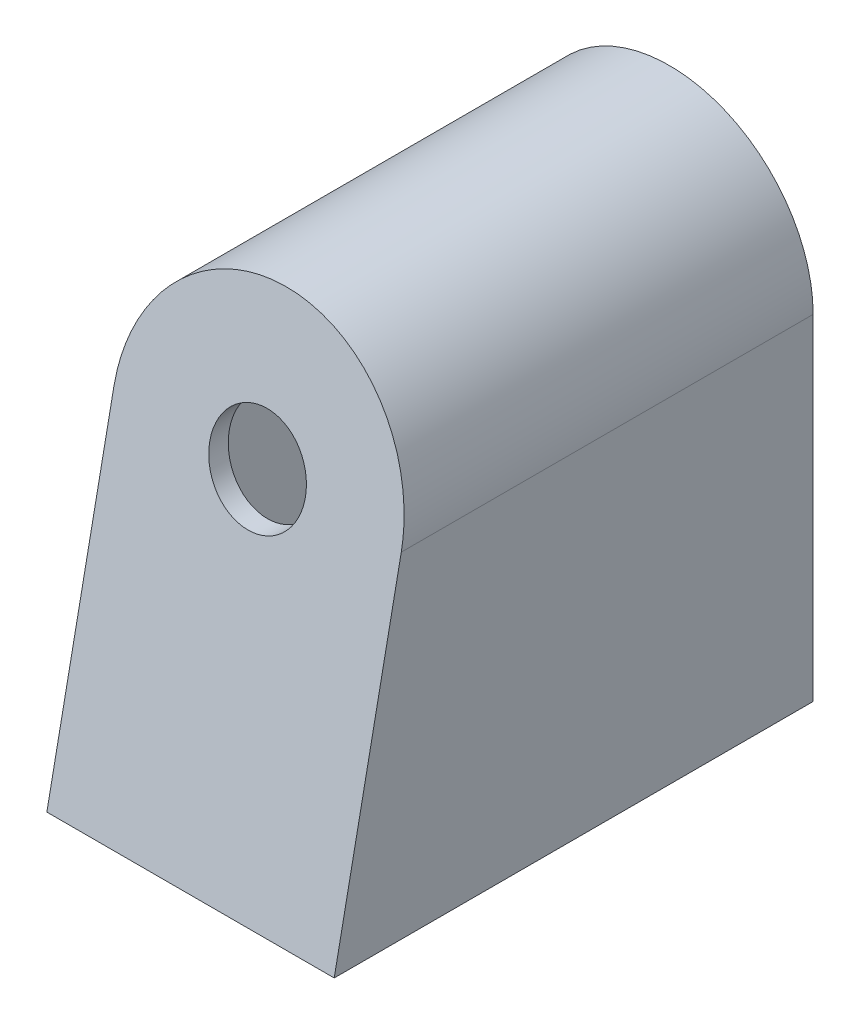
ISO-10303-21;
HEADER;
FILE_DESCRIPTION(('STEP AP214'),'2;1');
FILE_NAME('part.step','',(''),(''),'','','');
FILE_SCHEMA(('AUTOMOTIVE_DESIGN { 1 0 10303 214 1 1 1 1 }'));
ENDSEC;
DATA;
#1=APPLICATION_CONTEXT('core data for automotive mechanical design processes');
#2=APPLICATION_PROTOCOL_DEFINITION('international standard','automotive_design',2000,#1);
#3=PRODUCT_CONTEXT('',#1,'mechanical');
#4=PRODUCT('Part','Part','',(#3));
#5=PRODUCT_RELATED_PRODUCT_CATEGORY('part','',(#4));
#6=PRODUCT_DEFINITION_FORMATION('','',#4);
#7=PRODUCT_DEFINITION_CONTEXT('part definition',#1,'design');
#8=PRODUCT_DEFINITION('design','',#6,#7);
#9=PRODUCT_DEFINITION_SHAPE('','',#8);
#10=(LENGTH_UNIT() NAMED_UNIT(*) SI_UNIT(.MILLI.,.METRE.));
#11=(NAMED_UNIT(*) PLANE_ANGLE_UNIT() SI_UNIT($,.RADIAN.));
#12=(NAMED_UNIT(*) SI_UNIT($,.STERADIAN.) SOLID_ANGLE_UNIT());
#13=UNCERTAINTY_MEASURE_WITH_UNIT(LENGTH_MEASURE(1.E-05),#10,'distance_accuracy_value','');
#14=(GEOMETRIC_REPRESENTATION_CONTEXT(3) GLOBAL_UNCERTAINTY_ASSIGNED_CONTEXT((#13)) GLOBAL_UNIT_ASSIGNED_CONTEXT((#10,
#11,#12)) REPRESENTATION_CONTEXT('',''));
#15=CARTESIAN_POINT('',(0.,0.,0.));
#16=DIRECTION('',(0.,0.,1.));
#17=DIRECTION('',(1.,0.,0.));
#18=AXIS2_PLACEMENT_3D('',#15,#16,#17);
#19=CARTESIAN_POINT('',(0.,17.5,-50.));
#20=DIRECTION('',(0.,0.,1.));
#21=DIRECTION('',(1.,0.,0.));
#22=AXIS2_PLACEMENT_3D('',#19,#20,#21);
#23=CYLINDRICAL_SURFACE('',#22,5.);
#24=CARTESIAN_POINT('',(0.,17.5,-7.));
#25=DIRECTION('',(0.,-0.196116135138184,-0.98058067569092));
#26=DIRECTION('',(0.,-0.98058067569092,0.196116135138184));
#27=AXIS2_PLACEMENT_3D('',#24,#25,#26);
#28=ELLIPSE('',#27,5.09901951359279,5.);
#29=CARTESIAN_POINT('',(0.,12.5,-6.));
#30=VERTEX_POINT('',#29);
#31=EDGE_CURVE('E116',#30,#30,#28,.F.);
#32=ORIENTED_EDGE('',*,*,#31,.T.);
#33=EDGE_LOOP('',(#32));
#34=FACE_BOUND('',#33,.T.);
#35=CARTESIAN_POINT('',(0.,17.5,-9.03960780543712));
#36=DIRECTION('',(0.,-0.196116135138184,-0.98058067569092));
#37=DIRECTION('',(0.,-0.98058067569092,0.196116135138184));
#38=AXIS2_PLACEMENT_3D('',#35,#36,#37);
#39=ELLIPSE('',#38,5.09901951359279,5.);
#40=CARTESIAN_POINT('',(0.,12.5,-8.03960780543712));
#41=VERTEX_POINT('',#40);
#42=EDGE_CURVE('E39',#41,#41,#39,.F.);
#43=ORIENTED_EDGE('',*,*,#42,.F.);
#44=EDGE_LOOP('',(#43));
#45=FACE_BOUND('',#44,.T.);
#46=ADVANCED_FACE('F35',(#34,#45),#23,.F.);
#47=CARTESIAN_POINT('',(0.,17.5,-50.));
#48=DIRECTION('',(0.,0.,1.));
#49=DIRECTION('',(1.,0.,0.));
#50=AXIS2_PLACEMENT_3D('',#47,#48,#49);
#51=CYLINDRICAL_SURFACE('',#50,15.);
#52=CARTESIAN_POINT('',(0.,17.5,-7.));
#53=DIRECTION('',(0.,-0.196116135138184,-0.98058067569092));
#54=DIRECTION('',(0.,-0.98058067569092,0.196116135138184));
#55=AXIS2_PLACEMENT_3D('',#52,#53,#54);
#56=ELLIPSE('',#55,15.2970585407784,15.);
#57=CARTESIAN_POINT('',(15.,17.5,-7.));
#58=VERTEX_POINT('',#57);
#59=CARTESIAN_POINT('',(-15.,17.5,-7.));
#60=VERTEX_POINT('',#59);
#61=EDGE_CURVE('E80',#58,#60,#56,.F.);
#62=ORIENTED_EDGE('',*,*,#61,.F.);
#63=DIRECTION('',(0.,0.,1.));
#64=VECTOR('',#63,1.);
#65=CARTESIAN_POINT('',(15.,17.5,-50.));
#66=LINE('',#65,#64);
#67=CARTESIAN_POINT('',(15.,17.5,-50.));
#68=VERTEX_POINT('',#67);
#69=EDGE_CURVE('E12',#68,#58,#66,.T.);
#70=ORIENTED_EDGE('',*,*,#69,.F.);
#71=CARTESIAN_POINT('',(0.,17.5,-50.));
#72=DIRECTION('',(0.,0.,1.));
#73=DIRECTION('',(1.,0.,0.));
#74=AXIS2_PLACEMENT_3D('',#71,#72,#73);
#75=CIRCLE('',#74,15.);
#76=CARTESIAN_POINT('',(-15.,17.5,-50.));
#77=VERTEX_POINT('',#76);
#78=EDGE_CURVE('E108',#68,#77,#75,.T.);
#79=ORIENTED_EDGE('',*,*,#78,.T.);
#80=DIRECTION('',(0.,0.,1.));
#81=VECTOR('',#80,1.);
#82=CARTESIAN_POINT('',(-15.,17.5,-50.));
#83=LINE('',#82,#81);
#84=EDGE_CURVE('E97',#77,#60,#83,.T.);
#85=ORIENTED_EDGE('',*,*,#84,.T.);
#86=EDGE_LOOP('',(#62,#70,#79,#85));
#87=FACE_BOUND('',#86,.T.);
#88=ADVANCED_FACE('F37',(#87),#51,.T.);
#89=CARTESIAN_POINT('',(15.,-17.5,-50.));
#90=DIRECTION('',(1.,0.,0.));
#91=DIRECTION('',(0.,0.,-1.));
#92=AXIS2_PLACEMENT_3D('',#89,#90,#91);
#93=PLANE('',#92);
#94=DIRECTION('',(0.,0.98058067569092,-0.196116135138184));
#95=VECTOR('',#94,1.);
#96=CARTESIAN_POINT('',(15.,-17.5,0.));
#97=LINE('',#96,#95);
#98=CARTESIAN_POINT('',(15.,-17.5,0.));
#99=VERTEX_POINT('',#98);
#100=EDGE_CURVE('E120',#99,#58,#97,.T.);
#101=ORIENTED_EDGE('',*,*,#100,.F.);
#102=DIRECTION('',(0.,0.,1.));
#103=VECTOR('',#102,1.);
#104=CARTESIAN_POINT('',(15.,-17.5,-50.));
#105=LINE('',#104,#103);
#106=CARTESIAN_POINT('',(15.,-17.5,-50.));
#107=VERTEX_POINT('',#106);
#108=EDGE_CURVE('E44',#107,#99,#105,.T.);
#109=ORIENTED_EDGE('',*,*,#108,.F.);
#110=DIRECTION('',(0.,1.,0.));
#111=VECTOR('',#110,1.);
#112=CARTESIAN_POINT('',(15.,-17.5,-50.));
#113=LINE('',#112,#111);
#114=EDGE_CURVE('E104',#107,#68,#113,.T.);
#115=ORIENTED_EDGE('',*,*,#114,.T.);
#116=ORIENTED_EDGE('',*,*,#69,.T.);
#117=EDGE_LOOP('',(#101,#109,#115,#116));
#118=FACE_BOUND('',#117,.T.);
#119=ADVANCED_FACE('F193',(#118),#93,.T.);
#120=CARTESIAN_POINT('',(-15.,-17.5,-50.));
#121=DIRECTION('',(0.,-1.,0.));
#122=DIRECTION('',(0.,0.,-1.));
#123=AXIS2_PLACEMENT_3D('',#120,#121,#122);
#124=PLANE('',#123);
#125=DIRECTION('',(1.,0.,0.));
#126=VECTOR('',#125,1.);
#127=CARTESIAN_POINT('',(-15.,-17.5,0.));
#128=LINE('',#127,#126);
#129=CARTESIAN_POINT('',(-15.,-17.5,0.));
#130=VERTEX_POINT('',#129);
#131=EDGE_CURVE('E94',#130,#99,#128,.T.);
#132=ORIENTED_EDGE('',*,*,#131,.F.);
#133=DIRECTION('',(0.,0.,1.));
#134=VECTOR('',#133,1.);
#135=CARTESIAN_POINT('',(-15.,-17.5,-50.));
#136=LINE('',#135,#134);
#137=CARTESIAN_POINT('',(-15.,-17.5,-50.));
#138=VERTEX_POINT('',#137);
#139=EDGE_CURVE('E88',#138,#130,#136,.T.);
#140=ORIENTED_EDGE('',*,*,#139,.F.);
#141=DIRECTION('',(1.,0.,0.));
#142=VECTOR('',#141,1.);
#143=CARTESIAN_POINT('',(-15.,-17.5,-50.));
#144=LINE('',#143,#142);
#145=EDGE_CURVE('E92',#138,#107,#144,.T.);
#146=ORIENTED_EDGE('',*,*,#145,.T.);
#147=ORIENTED_EDGE('',*,*,#108,.T.);
#148=EDGE_LOOP('',(#132,#140,#146,#147));
#149=FACE_BOUND('',#148,.T.);
#150=ADVANCED_FACE('F90',(#149),#124,.T.);
#151=CARTESIAN_POINT('',(-15.,-17.5,-50.));
#152=DIRECTION('',(-1.,0.,0.));
#153=DIRECTION('',(0.,0.,1.));
#154=AXIS2_PLACEMENT_3D('',#151,#152,#153);
#155=PLANE('',#154);
#156=DIRECTION('',(0.,0.98058067569092,-0.196116135138184));
#157=VECTOR('',#156,1.);
#158=CARTESIAN_POINT('',(-15.,-17.5,0.));
#159=LINE('',#158,#157);
#160=EDGE_CURVE('E73',#130,#60,#159,.T.);
#161=ORIENTED_EDGE('',*,*,#160,.T.);
#162=ORIENTED_EDGE('',*,*,#84,.F.);
#163=DIRECTION('',(0.,-1.,0.));
#164=VECTOR('',#163,1.);
#165=CARTESIAN_POINT('',(-15.,-17.5,-50.));
#166=LINE('',#165,#164);
#167=EDGE_CURVE('E102',#77,#138,#166,.T.);
#168=ORIENTED_EDGE('',*,*,#167,.T.);
#169=ORIENTED_EDGE('',*,*,#139,.T.);
#170=EDGE_LOOP('',(#161,#162,#168,#169));
#171=FACE_BOUND('',#170,.T.);
#172=ADVANCED_FACE('F106',(#171),#155,.T.);
#173=CARTESIAN_POINT('',(0.,17.5,-50.));
#174=DIRECTION('',(0.,0.,1.));
#175=DIRECTION('',(1.,0.,0.));
#176=AXIS2_PLACEMENT_3D('',#173,#174,#175);
#177=PLANE('',#176);
#178=DIRECTION('',(0.,-1.,0.));
#179=VECTOR('',#178,1.);
#180=CARTESIAN_POINT('',(13.,17.5,-50.));
#181=LINE('',#180,#179);
#182=CARTESIAN_POINT('',(13.,17.5,-50.));
#183=VERTEX_POINT('',#182);
#184=CARTESIAN_POINT('',(13.,-15.5,-50.));
#185=VERTEX_POINT('',#184);
#186=EDGE_CURVE('E145',#183,#185,#181,.T.);
#187=ORIENTED_EDGE('',*,*,#186,.F.);
#188=CARTESIAN_POINT('',(0.,17.5,-50.));
#189=DIRECTION('',(0.,0.,-1.));
#190=DIRECTION('',(-1.,0.,0.));
#191=AXIS2_PLACEMENT_3D('',#188,#189,#190);
#192=CIRCLE('',#191,13.);
#193=CARTESIAN_POINT('',(-13.,17.5,-50.));
#194=VERTEX_POINT('',#193);
#195=EDGE_CURVE('E52',#194,#183,#192,.T.);
#196=ORIENTED_EDGE('',*,*,#195,.F.);
#197=DIRECTION('',(0.,1.,0.));
#198=VECTOR('',#197,1.);
#199=CARTESIAN_POINT('',(-13.,-15.5,-50.));
#200=LINE('',#199,#198);
#201=CARTESIAN_POINT('',(-13.,-15.5,-50.));
#202=VERTEX_POINT('',#201);
#203=EDGE_CURVE('E131',#202,#194,#200,.T.);
#204=ORIENTED_EDGE('',*,*,#203,.F.);
#205=DIRECTION('',(-1.,0.,0.));
#206=VECTOR('',#205,1.);
#207=CARTESIAN_POINT('',(13.,-15.5,-50.));
#208=LINE('',#207,#206);
#209=EDGE_CURVE('E142',#185,#202,#208,.T.);
#210=ORIENTED_EDGE('',*,*,#209,.F.);
#211=EDGE_LOOP('',(#187,#196,#204,#210));
#212=FACE_BOUND('',#211,.T.);
#213=ORIENTED_EDGE('',*,*,#78,.F.);
#214=ORIENTED_EDGE('',*,*,#114,.F.);
#215=ORIENTED_EDGE('',*,*,#145,.F.);
#216=ORIENTED_EDGE('',*,*,#167,.F.);
#217=EDGE_LOOP('',(#213,#214,#215,#216));
#218=FACE_BOUND('',#217,.T.);
#219=ADVANCED_FACE('F101',(#212,#218),#177,.F.);
#220=CARTESIAN_POINT('',(-15.,-17.5,0.));
#221=DIRECTION('',(0.,-0.196116135138184,-0.98058067569092));
#222=DIRECTION('',(0.,0.98058067569092,-0.196116135138184));
#223=AXIS2_PLACEMENT_3D('',#220,#221,#222);
#224=PLANE('',#223);
#225=ORIENTED_EDGE('',*,*,#61,.T.);
#226=ORIENTED_EDGE('',*,*,#160,.F.);
#227=ORIENTED_EDGE('',*,*,#131,.T.);
#228=ORIENTED_EDGE('',*,*,#100,.T.);
#229=EDGE_LOOP('',(#225,#226,#227,#228));
#230=FACE_BOUND('',#229,.T.);
#231=ORIENTED_EDGE('',*,*,#31,.F.);
#232=EDGE_LOOP('',(#231));
#233=FACE_BOUND('',#232,.T.);
#234=ADVANCED_FACE('F190',(#230,#233),#224,.F.);
#235=CARTESIAN_POINT('',(-15.,-17.8922322702764,-1.96116135138184));
#236=DIRECTION('',(0.,-0.196116135138184,-0.98058067569092));
#237=DIRECTION('',(0.,0.98058067569092,-0.196116135138184));
#238=AXIS2_PLACEMENT_3D('',#235,#236,#237);
#239=PLANE('',#238);
#240=CARTESIAN_POINT('',(0.,17.5,-9.03960780543712));
#241=DIRECTION('',(0.,-0.196116135138184,-0.98058067569092));
#242=DIRECTION('',(0.,0.98058067569092,-0.196116135138184));
#243=AXIS2_PLACEMENT_3D('',#240,#241,#242);
#244=ELLIPSE('',#243,13.2574507353412,13.);
#245=CARTESIAN_POINT('',(13.,17.5,-9.03960780543712));
#246=VERTEX_POINT('',#245);
#247=CARTESIAN_POINT('',(-13.,17.5,-9.03960780543712));
#248=VERTEX_POINT('',#247);
#249=EDGE_CURVE('E127',#246,#248,#244,.F.);
#250=ORIENTED_EDGE('',*,*,#249,.F.);
#251=DIRECTION('',(0.,0.98058067569092,-0.196116135138184));
#252=VECTOR('',#251,1.);
#253=CARTESIAN_POINT('',(13.,6.4687322658223,-6.83335425860158));
#254=LINE('',#253,#252);
#255=CARTESIAN_POINT('',(13.,-15.5,-2.43960780543711));
#256=VERTEX_POINT('',#255);
#257=EDGE_CURVE('E124',#256,#246,#254,.T.);
#258=ORIENTED_EDGE('',*,*,#257,.F.);
#259=DIRECTION('',(1.,0.,0.));
#260=VECTOR('',#259,1.);
#261=CARTESIAN_POINT('',(13.,-15.5,-2.43960780543711));
#262=LINE('',#261,#260);
#263=CARTESIAN_POINT('',(-13.,-15.5,-2.43960780543711));
#264=VERTEX_POINT('',#263);
#265=EDGE_CURVE('E139',#264,#256,#262,.T.);
#266=ORIENTED_EDGE('',*,*,#265,.F.);
#267=DIRECTION('',(0.,-0.98058067569092,0.196116135138184));
#268=VECTOR('',#267,1.);
#269=CARTESIAN_POINT('',(-13.,-25.2620369649469,-0.487200412447729));
#270=LINE('',#269,#268);
#271=EDGE_CURVE('E151',#248,#264,#270,.T.);
#272=ORIENTED_EDGE('',*,*,#271,.F.);
#273=EDGE_LOOP('',(#250,#258,#266,#272));
#274=FACE_BOUND('',#273,.T.);
#275=ORIENTED_EDGE('',*,*,#42,.T.);
#276=EDGE_LOOP('',(#275));
#277=FACE_BOUND('',#276,.T.);
#278=ADVANCED_FACE('F174',(#274,#277),#239,.T.);
#279=CARTESIAN_POINT('',(0.,17.5,48.3229844122869));
#280=DIRECTION('',(0.,0.,-1.));
#281=DIRECTION('',(-1.,0.,0.));
#282=AXIS2_PLACEMENT_3D('',#279,#280,#281);
#283=CYLINDRICAL_SURFACE('',#282,13.);
#284=ORIENTED_EDGE('',*,*,#249,.T.);
#285=DIRECTION('',(0.,0.,-1.));
#286=VECTOR('',#285,1.);
#287=CARTESIAN_POINT('',(-13.,17.5,48.3229844122869));
#288=LINE('',#287,#286);
#289=EDGE_CURVE('E137',#248,#194,#288,.T.);
#290=ORIENTED_EDGE('',*,*,#289,.T.);
#291=ORIENTED_EDGE('',*,*,#195,.T.);
#292=DIRECTION('',(0.,0.,-1.));
#293=VECTOR('',#292,1.);
#294=CARTESIAN_POINT('',(13.,17.5,48.3229844122869));
#295=LINE('',#294,#293);
#296=EDGE_CURVE('E128',#246,#183,#295,.T.);
#297=ORIENTED_EDGE('',*,*,#296,.F.);
#298=EDGE_LOOP('',(#284,#290,#291,#297));
#299=FACE_BOUND('',#298,.T.);
#300=ADVANCED_FACE('F179',(#299),#283,.F.);
#301=CARTESIAN_POINT('',(-13.,-15.5,48.3229844122869));
#302=DIRECTION('',(-1.,0.,0.));
#303=DIRECTION('',(0.,-1.,0.));
#304=AXIS2_PLACEMENT_3D('',#301,#302,#303);
#305=PLANE('',#304);
#306=ORIENTED_EDGE('',*,*,#271,.T.);
#307=DIRECTION('',(0.,0.,-1.));
#308=VECTOR('',#307,1.);
#309=CARTESIAN_POINT('',(-13.,-15.5,48.3229844122869));
#310=LINE('',#309,#308);
#311=EDGE_CURVE('E134',#264,#202,#310,.T.);
#312=ORIENTED_EDGE('',*,*,#311,.T.);
#313=ORIENTED_EDGE('',*,*,#203,.T.);
#314=ORIENTED_EDGE('',*,*,#289,.F.);
#315=EDGE_LOOP('',(#306,#312,#313,#314));
#316=FACE_BOUND('',#315,.T.);
#317=ADVANCED_FACE('F262',(#316),#305,.F.);
#318=CARTESIAN_POINT('',(13.,-15.5,48.3229844122869));
#319=DIRECTION('',(0.,-1.,0.));
#320=DIRECTION('',(0.,0.,-1.));
#321=AXIS2_PLACEMENT_3D('',#318,#319,#320);
#322=PLANE('',#321);
#323=ORIENTED_EDGE('',*,*,#265,.T.);
#324=DIRECTION('',(0.,0.,-1.));
#325=VECTOR('',#324,1.);
#326=CARTESIAN_POINT('',(13.,-15.5,48.3229844122869));
#327=LINE('',#326,#325);
#328=EDGE_CURVE('E130',#256,#185,#327,.T.);
#329=ORIENTED_EDGE('',*,*,#328,.T.);
#330=ORIENTED_EDGE('',*,*,#209,.T.);
#331=ORIENTED_EDGE('',*,*,#311,.F.);
#332=EDGE_LOOP('',(#323,#329,#330,#331));
#333=FACE_BOUND('',#332,.T.);
#334=ADVANCED_FACE('F160',(#333),#322,.F.);
#335=CARTESIAN_POINT('',(13.,17.5,48.3229844122869));
#336=DIRECTION('',(1.,0.,0.));
#337=DIRECTION('',(0.,0.,-1.));
#338=AXIS2_PLACEMENT_3D('',#335,#336,#337);
#339=PLANE('',#338);
#340=ORIENTED_EDGE('',*,*,#257,.T.);
#341=ORIENTED_EDGE('',*,*,#296,.T.);
#342=ORIENTED_EDGE('',*,*,#186,.T.);
#343=ORIENTED_EDGE('',*,*,#328,.F.);
#344=EDGE_LOOP('',(#340,#341,#342,#343));
#345=FACE_BOUND('',#344,.T.);
#346=ADVANCED_FACE('F170',(#345),#339,.F.);
#347=CLOSED_SHELL('',(#46,#88,#119,#150,#172,#219,#234,#278,#300,#317,#334,#346));
#348=MANIFOLD_SOLID_BREP('B2',#347);
#349=ADVANCED_BREP_SHAPE_REPRESENTATION('',(#18,#348),#14);
#350=SHAPE_DEFINITION_REPRESENTATION(#9,#349);
ENDSEC;
END-ISO-10303-21;
